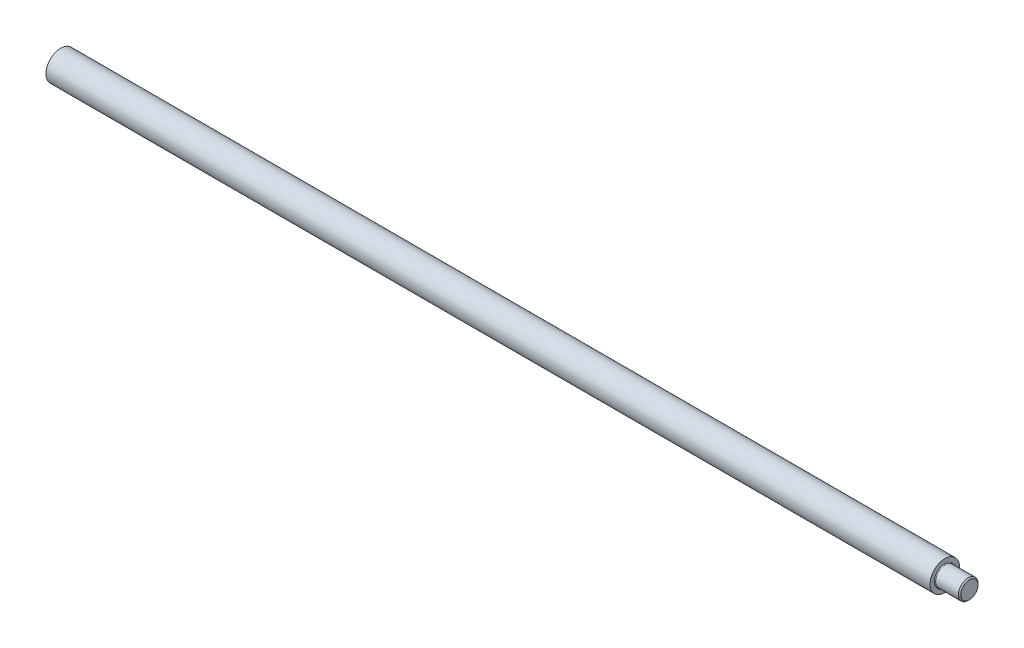
ISO-10303-21;
HEADER;
FILE_DESCRIPTION(('STEP AP214'),'2;1');
FILE_NAME('part.step','',(''),(''),'','','');
FILE_SCHEMA(('AUTOMOTIVE_DESIGN { 1 0 10303 214 1 1 1 1 }'));
ENDSEC;
DATA;
#1=APPLICATION_CONTEXT('core data for automotive mechanical design processes');
#2=APPLICATION_PROTOCOL_DEFINITION('international standard','automotive_design',2000,#1);
#3=PRODUCT_CONTEXT('',#1,'mechanical');
#4=PRODUCT('Part','Part','',(#3));
#5=PRODUCT_RELATED_PRODUCT_CATEGORY('part','',(#4));
#6=PRODUCT_DEFINITION_FORMATION('','',#4);
#7=PRODUCT_DEFINITION_CONTEXT('part definition',#1,'design');
#8=PRODUCT_DEFINITION('design','',#6,#7);
#9=PRODUCT_DEFINITION_SHAPE('','',#8);
#10=(LENGTH_UNIT() NAMED_UNIT(*) SI_UNIT(.MILLI.,.METRE.));
#11=(NAMED_UNIT(*) PLANE_ANGLE_UNIT() SI_UNIT($,.RADIAN.));
#12=(NAMED_UNIT(*) SI_UNIT($,.STERADIAN.) SOLID_ANGLE_UNIT());
#13=UNCERTAINTY_MEASURE_WITH_UNIT(LENGTH_MEASURE(1.E-05),#10,'distance_accuracy_value','');
#14=(GEOMETRIC_REPRESENTATION_CONTEXT(3) GLOBAL_UNCERTAINTY_ASSIGNED_CONTEXT((#13)) GLOBAL_UNIT_ASSIGNED_CONTEXT((#10,
#11,#12)) REPRESENTATION_CONTEXT('',''));
#15=CARTESIAN_POINT('',(0.,0.,0.));
#16=DIRECTION('',(0.,0.,1.));
#17=DIRECTION('',(1.,0.,0.));
#18=AXIS2_PLACEMENT_3D('',#15,#16,#17);
#19=CARTESIAN_POINT('',(10.,0.,0.));
#20=DIRECTION('',(1.,0.,0.));
#21=DIRECTION('',(0.,0.,-1.));
#22=AXIS2_PLACEMENT_3D('',#19,#20,#21);
#23=CYLINDRICAL_SURFACE('',#22,5.68421052631579);
#24=CARTESIAN_POINT('',(10.,0.,0.));
#25=DIRECTION('',(1.,0.,0.));
#26=DIRECTION('',(0.,0.,-1.));
#27=AXIS2_PLACEMENT_3D('',#24,#25,#26);
#28=CIRCLE('',#27,5.68421052631579);
#29=CARTESIAN_POINT('',(10.,0.,-5.68421052631579));
#30=VERTEX_POINT('',#29);
#31=EDGE_CURVE('E53',#30,#30,#28,.T.);
#32=ORIENTED_EDGE('',*,*,#31,.T.);
#33=EDGE_LOOP('',(#32));
#34=FACE_BOUND('',#33,.T.);
#35=CARTESIAN_POINT('',(350.526315789474,0.,0.));
#36=DIRECTION('',(1.,0.,0.));
#37=DIRECTION('',(0.,0.,-1.));
#38=AXIS2_PLACEMENT_3D('',#35,#36,#37);
#39=CIRCLE('',#38,5.68421052631579);
#40=CARTESIAN_POINT('',(350.526315789474,0.,-5.68421052631579));
#41=VERTEX_POINT('',#40);
#42=EDGE_CURVE('E10',#41,#41,#39,.T.);
#43=ORIENTED_EDGE('',*,*,#42,.F.);
#44=EDGE_LOOP('',(#43));
#45=FACE_BOUND('',#44,.T.);
#46=ADVANCED_FACE('F31',(#34,#45),#23,.T.);
#47=CARTESIAN_POINT('',(350.526315789474,4.07368421052639,0.));
#48=DIRECTION('',(1.,0.,0.));
#49=DIRECTION('',(0.,0.,-1.));
#50=AXIS2_PLACEMENT_3D('',#47,#48,#49);
#51=PLANE('',#50);
#52=ORIENTED_EDGE('',*,*,#42,.T.);
#53=EDGE_LOOP('',(#52));
#54=FACE_BOUND('',#53,.T.);
#55=CARTESIAN_POINT('',(350.526315789474,0.,0.));
#56=DIRECTION('',(1.,0.,0.));
#57=DIRECTION('',(0.,0.,-1.));
#58=AXIS2_PLACEMENT_3D('',#55,#56,#57);
#59=CIRCLE('',#58,4.07368421052639);
#60=CARTESIAN_POINT('',(350.526315789474,0.,-4.07368421052639));
#61=VERTEX_POINT('',#60);
#62=EDGE_CURVE('E37',#61,#61,#59,.T.);
#63=ORIENTED_EDGE('',*,*,#62,.F.);
#64=EDGE_LOOP('',(#63));
#65=FACE_BOUND('',#64,.T.);
#66=ADVANCED_FACE('F70',(#54,#65),#51,.T.);
#67=CARTESIAN_POINT('',(350.81052631579,0.,0.));
#68=DIRECTION('',(1.,0.,0.));
#69=DIRECTION('',(0.,0.,-1.));
#70=AXIS2_PLACEMENT_3D('',#67,#68,#69);
#71=TOROIDAL_SURFACE('',#70,4.07368421052639,0.284210526315843);
#72=ORIENTED_EDGE('',*,*,#62,.T.);
#73=EDGE_LOOP('',(#72));
#74=FACE_BOUND('',#73,.T.);
#75=CARTESIAN_POINT('',(350.81052631579,0.,0.));
#76=DIRECTION('',(1.,0.,0.));
#77=DIRECTION('',(0.,0.,-1.));
#78=AXIS2_PLACEMENT_3D('',#75,#76,#77);
#79=CIRCLE('',#78,3.78947368421054);
#80=CARTESIAN_POINT('',(350.81052631579,0.,-3.78947368421054));
#81=VERTEX_POINT('',#80);
#82=EDGE_CURVE('E41',#81,#81,#79,.T.);
#83=ORIENTED_EDGE('',*,*,#82,.F.);
#84=EDGE_LOOP('',(#83));
#85=FACE_BOUND('',#84,.T.);
#86=ADVANCED_FACE('F74',(#74,#85),#71,.F.);
#87=CARTESIAN_POINT('',(10.,0.,0.));
#88=DIRECTION('',(1.,0.,0.));
#89=DIRECTION('',(0.,0.,-1.));
#90=AXIS2_PLACEMENT_3D('',#87,#88,#89);
#91=CYLINDRICAL_SURFACE('',#90,3.78947368421054);
#92=ORIENTED_EDGE('',*,*,#82,.T.);
#93=EDGE_LOOP('',(#92));
#94=FACE_BOUND('',#93,.T.);
#95=CARTESIAN_POINT('',(359.526315789474,0.,0.));
#96=DIRECTION('',(1.,0.,0.));
#97=DIRECTION('',(0.,0.,-1.));
#98=AXIS2_PLACEMENT_3D('',#95,#96,#97);
#99=CIRCLE('',#98,3.78947368421054);
#100=CARTESIAN_POINT('',(359.526315789474,0.,-3.78947368421054));
#101=VERTEX_POINT('',#100);
#102=EDGE_CURVE('E45',#101,#101,#99,.T.);
#103=ORIENTED_EDGE('',*,*,#102,.F.);
#104=EDGE_LOOP('',(#103));
#105=FACE_BOUND('',#104,.T.);
#106=ADVANCED_FACE('F78',(#94,#105),#91,.T.);
#107=CARTESIAN_POINT('',(360.,0.,0.));
#108=DIRECTION('',(-1.,0.,0.));
#109=DIRECTION('',(0.,0.,1.));
#110=AXIS2_PLACEMENT_3D('',#107,#108,#109);
#111=CONICAL_SURFACE('',#110,3.31578947368422,0.785398163397468);
#112=ORIENTED_EDGE('',*,*,#102,.T.);
#113=EDGE_LOOP('',(#112));
#114=FACE_BOUND('',#113,.T.);
#115=CARTESIAN_POINT('',(360.,0.,0.));
#116=DIRECTION('',(1.,0.,0.));
#117=DIRECTION('',(0.,0.,-1.));
#118=AXIS2_PLACEMENT_3D('',#115,#116,#117);
#119=CIRCLE('',#118,3.31578947368422);
#120=CARTESIAN_POINT('',(360.,0.,-3.31578947368422));
#121=VERTEX_POINT('',#120);
#122=EDGE_CURVE('E50',#121,#121,#119,.T.);
#123=ORIENTED_EDGE('',*,*,#122,.F.);
#124=EDGE_LOOP('',(#123));
#125=FACE_BOUND('',#124,.T.);
#126=ADVANCED_FACE('F66',(#114,#125),#111,.T.);
#127=CARTESIAN_POINT('',(360.,0.,0.));
#128=DIRECTION('',(1.,0.,0.));
#129=DIRECTION('',(0.,0.,-1.));
#130=AXIS2_PLACEMENT_3D('',#127,#128,#129);
#131=PLANE('',#130);
#132=ORIENTED_EDGE('',*,*,#122,.T.);
#133=EDGE_LOOP('',(#132));
#134=FACE_BOUND('',#133,.T.);
#135=ADVANCED_FACE('F61',(#134),#131,.T.);
#136=CARTESIAN_POINT('',(10.,5.68421052631579,0.));
#137=DIRECTION('',(-1.,0.,0.));
#138=DIRECTION('',(0.,0.,1.));
#139=AXIS2_PLACEMENT_3D('',#136,#137,#138);
#140=PLANE('',#139);
#141=ORIENTED_EDGE('',*,*,#31,.F.);
#142=EDGE_LOOP('',(#141));
#143=FACE_BOUND('',#142,.T.);
#144=ADVANCED_FACE('F59',(#143),#140,.T.);
#145=CLOSED_SHELL('',(#46,#66,#86,#106,#126,#135,#144));
#146=MANIFOLD_SOLID_BREP('B2',#145);
#147=ADVANCED_BREP_SHAPE_REPRESENTATION('',(#18,#146),#14);
#148=SHAPE_DEFINITION_REPRESENTATION(#9,#147);
ENDSEC;
END-ISO-10303-21;
